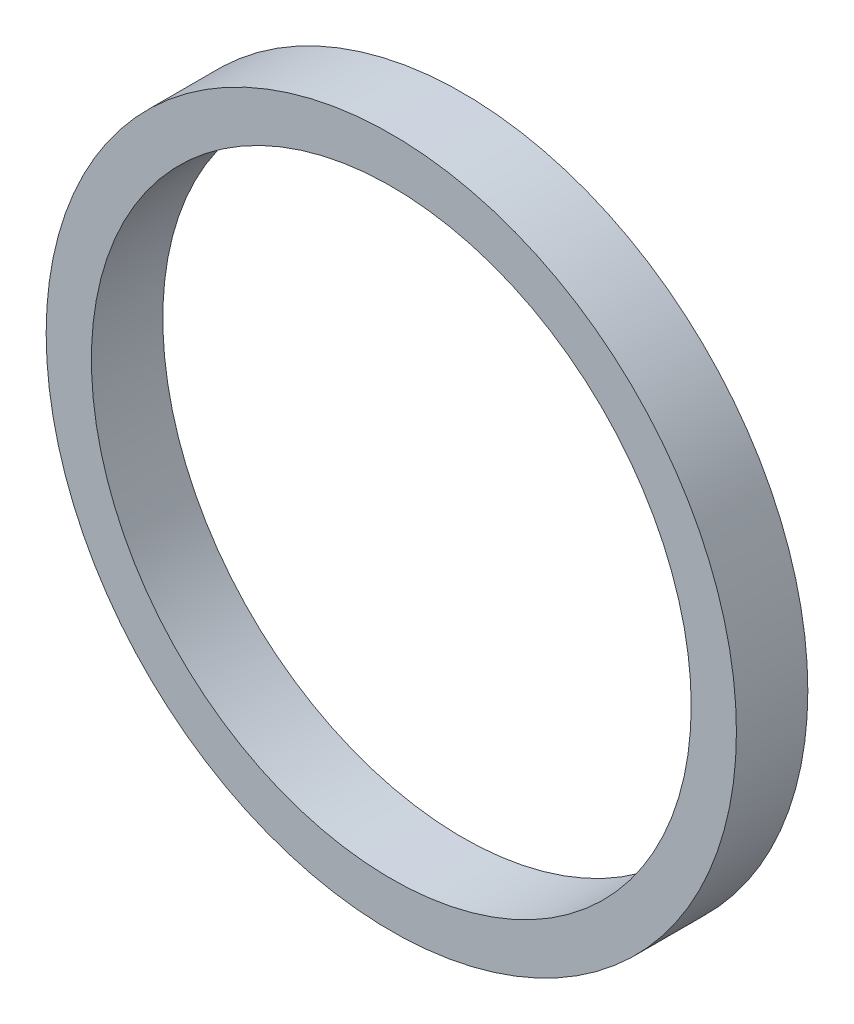
ISO-10303-21;
HEADER;
FILE_DESCRIPTION(('STEP AP214'),'2;1');
FILE_NAME('part.step','',(''),(''),'','','');
FILE_SCHEMA(('AUTOMOTIVE_DESIGN { 1 0 10303 214 1 1 1 1 }'));
ENDSEC;
DATA;
#1=APPLICATION_CONTEXT('core data for automotive mechanical design processes');
#2=APPLICATION_PROTOCOL_DEFINITION('international standard','automotive_design',2000,#1);
#3=PRODUCT_CONTEXT('',#1,'mechanical');
#4=PRODUCT('Part','Part','',(#3));
#5=PRODUCT_RELATED_PRODUCT_CATEGORY('part','',(#4));
#6=PRODUCT_DEFINITION_FORMATION('','',#4);
#7=PRODUCT_DEFINITION_CONTEXT('part definition',#1,'design');
#8=PRODUCT_DEFINITION('design','',#6,#7);
#9=PRODUCT_DEFINITION_SHAPE('','',#8);
#10=(LENGTH_UNIT() NAMED_UNIT(*) SI_UNIT(.MILLI.,.METRE.));
#11=(NAMED_UNIT(*) PLANE_ANGLE_UNIT() SI_UNIT($,.RADIAN.));
#12=(NAMED_UNIT(*) SI_UNIT($,.STERADIAN.) SOLID_ANGLE_UNIT());
#13=UNCERTAINTY_MEASURE_WITH_UNIT(LENGTH_MEASURE(1.E-05),#10,'distance_accuracy_value','');
#14=(GEOMETRIC_REPRESENTATION_CONTEXT(3) GLOBAL_UNCERTAINTY_ASSIGNED_CONTEXT((#13)) GLOBAL_UNIT_ASSIGNED_CONTEXT((#10,
#11,#12)) REPRESENTATION_CONTEXT('',''));
#15=CARTESIAN_POINT('',(0.,0.,0.));
#16=DIRECTION('',(0.,0.,1.));
#17=DIRECTION('',(1.,0.,0.));
#18=AXIS2_PLACEMENT_3D('',#15,#16,#17);
#19=CARTESIAN_POINT('',(0.,0.,3.));
#20=DIRECTION('',(0.,0.,1.));
#21=DIRECTION('',(1.,0.,0.));
#22=AXIS2_PLACEMENT_3D('',#19,#20,#21);
#23=PLANE('',#22);
#24=CARTESIAN_POINT('',(0.,0.,3.));
#25=DIRECTION('',(0.,0.,1.));
#26=DIRECTION('',(1.,0.,0.));
#27=AXIS2_PLACEMENT_3D('',#24,#25,#26);
#28=CIRCLE('',#27,14.5);
#29=CARTESIAN_POINT('',(14.5,0.,3.));
#30=VERTEX_POINT('',#29);
#31=EDGE_CURVE('E10',#30,#30,#28,.T.);
#32=ORIENTED_EDGE('',*,*,#31,.T.);
#33=EDGE_LOOP('',(#32));
#34=FACE_BOUND('',#33,.T.);
#35=CARTESIAN_POINT('',(0.,0.,3.));
#36=DIRECTION('',(0.,0.,1.));
#37=DIRECTION('',(1.,0.,0.));
#38=AXIS2_PLACEMENT_3D('',#35,#36,#37);
#39=CIRCLE('',#38,12.6);
#40=CARTESIAN_POINT('',(12.6,0.,3.));
#41=VERTEX_POINT('',#40);
#42=EDGE_CURVE('E41',#41,#41,#39,.T.);
#43=ORIENTED_EDGE('',*,*,#42,.F.);
#44=EDGE_LOOP('',(#43));
#45=FACE_BOUND('',#44,.T.);
#46=ADVANCED_FACE('F30',(#34,#45),#23,.T.);
#47=CARTESIAN_POINT('',(0.,0.,0.));
#48=DIRECTION('',(0.,0.,1.));
#49=DIRECTION('',(1.,0.,0.));
#50=AXIS2_PLACEMENT_3D('',#47,#48,#49);
#51=PLANE('',#50);
#52=CARTESIAN_POINT('',(0.,0.,0.));
#53=DIRECTION('',(0.,0.,1.));
#54=DIRECTION('',(1.,0.,0.));
#55=AXIS2_PLACEMENT_3D('',#52,#53,#54);
#56=CIRCLE('',#55,14.5);
#57=CARTESIAN_POINT('',(14.5,0.,0.));
#58=VERTEX_POINT('',#57);
#59=EDGE_CURVE('E34',#58,#58,#56,.T.);
#60=ORIENTED_EDGE('',*,*,#59,.F.);
#61=EDGE_LOOP('',(#60));
#62=FACE_BOUND('',#61,.T.);
#63=CARTESIAN_POINT('',(0.,0.,0.));
#64=DIRECTION('',(0.,0.,1.));
#65=DIRECTION('',(1.,0.,0.));
#66=AXIS2_PLACEMENT_3D('',#63,#64,#65);
#67=CIRCLE('',#66,12.6);
#68=CARTESIAN_POINT('',(12.6,0.,0.));
#69=VERTEX_POINT('',#68);
#70=EDGE_CURVE('E43',#69,#69,#67,.T.);
#71=ORIENTED_EDGE('',*,*,#70,.T.);
#72=EDGE_LOOP('',(#71));
#73=FACE_BOUND('',#72,.T.);
#74=ADVANCED_FACE('F53',(#62,#73),#51,.F.);
#75=CARTESIAN_POINT('',(0.,0.,3.));
#76=DIRECTION('',(0.,0.,-1.));
#77=DIRECTION('',(-1.,0.,0.));
#78=AXIS2_PLACEMENT_3D('',#75,#76,#77);
#79=CYLINDRICAL_SURFACE('',#78,14.5);
#80=ORIENTED_EDGE('',*,*,#31,.F.);
#81=EDGE_LOOP('',(#80));
#82=FACE_BOUND('',#81,.T.);
#83=ORIENTED_EDGE('',*,*,#59,.T.);
#84=EDGE_LOOP('',(#83));
#85=FACE_BOUND('',#84,.T.);
#86=ADVANCED_FACE('F32',(#82,#85),#79,.T.);
#87=CARTESIAN_POINT('',(0.,0.,3.));
#88=DIRECTION('',(0.,0.,-1.));
#89=DIRECTION('',(-1.,0.,0.));
#90=AXIS2_PLACEMENT_3D('',#87,#88,#89);
#91=CYLINDRICAL_SURFACE('',#90,12.6);
#92=ORIENTED_EDGE('',*,*,#42,.T.);
#93=EDGE_LOOP('',(#92));
#94=FACE_BOUND('',#93,.T.);
#95=ORIENTED_EDGE('',*,*,#70,.F.);
#96=EDGE_LOOP('',(#95));
#97=FACE_BOUND('',#96,.T.);
#98=ADVANCED_FACE('F49',(#94,#97),#91,.F.);
#99=CLOSED_SHELL('',(#46,#74,#86,#98));
#100=MANIFOLD_SOLID_BREP('B2',#99);
#101=ADVANCED_BREP_SHAPE_REPRESENTATION('',(#18,#100),#14);
#102=SHAPE_DEFINITION_REPRESENTATION(#9,#101);
ENDSEC;
END-ISO-10303-21;
